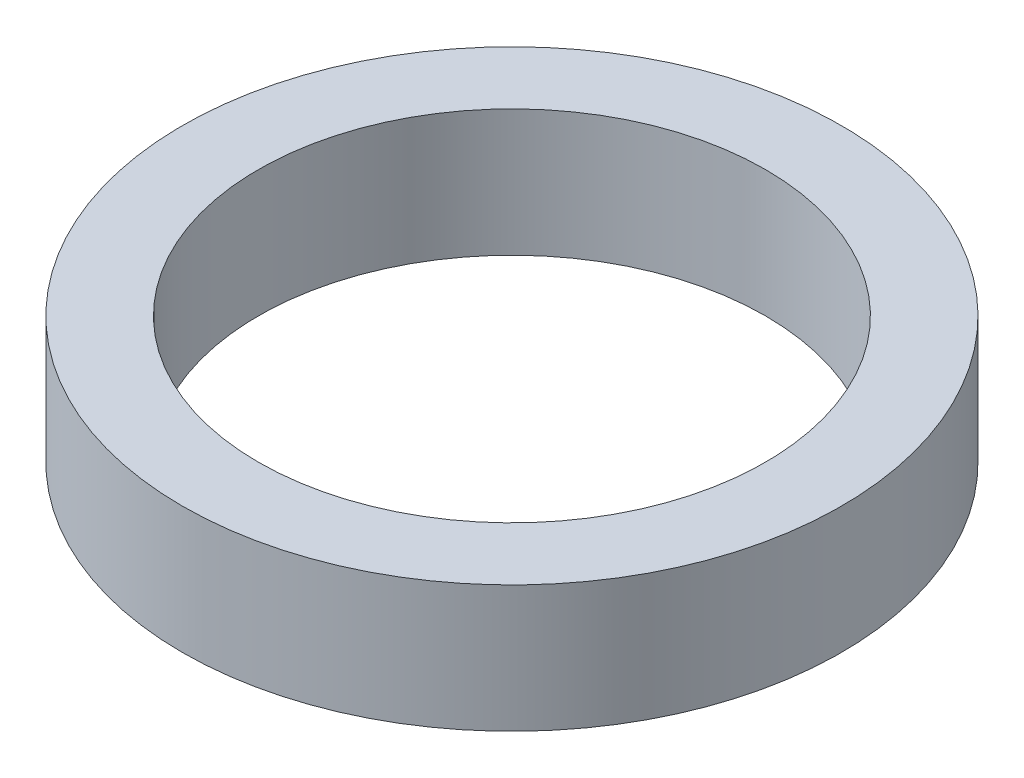
ISO-10303-21;
HEADER;
FILE_DESCRIPTION(('STEP AP214'),'2;1');
FILE_NAME('part.step','',(''),(''),'','','');
FILE_SCHEMA(('AUTOMOTIVE_DESIGN { 1 0 10303 214 1 1 1 1 }'));
ENDSEC;
DATA;
#1=APPLICATION_CONTEXT('core data for automotive mechanical design processes');
#2=APPLICATION_PROTOCOL_DEFINITION('international standard','automotive_design',2000,#1);
#3=PRODUCT_CONTEXT('',#1,'mechanical');
#4=PRODUCT('Part','Part','',(#3));
#5=PRODUCT_RELATED_PRODUCT_CATEGORY('part','',(#4));
#6=PRODUCT_DEFINITION_FORMATION('','',#4);
#7=PRODUCT_DEFINITION_CONTEXT('part definition',#1,'design');
#8=PRODUCT_DEFINITION('design','',#6,#7);
#9=PRODUCT_DEFINITION_SHAPE('','',#8);
#10=(LENGTH_UNIT() NAMED_UNIT(*) SI_UNIT(.MILLI.,.METRE.));
#11=(NAMED_UNIT(*) PLANE_ANGLE_UNIT() SI_UNIT($,.RADIAN.));
#12=(NAMED_UNIT(*) SI_UNIT($,.STERADIAN.) SOLID_ANGLE_UNIT());
#13=UNCERTAINTY_MEASURE_WITH_UNIT(LENGTH_MEASURE(1.E-05),#10,'distance_accuracy_value','');
#14=(GEOMETRIC_REPRESENTATION_CONTEXT(3) GLOBAL_UNCERTAINTY_ASSIGNED_CONTEXT((#13)) GLOBAL_UNIT_ASSIGNED_CONTEXT((#10,
#11,#12)) REPRESENTATION_CONTEXT('',''));
#15=CARTESIAN_POINT('',(0.,0.,0.));
#16=DIRECTION('',(0.,0.,1.));
#17=DIRECTION('',(1.,0.,0.));
#18=AXIS2_PLACEMENT_3D('',#15,#16,#17);
#19=CARTESIAN_POINT('',(0.,1.,0.));
#20=DIRECTION('',(0.,1.,0.));
#21=DIRECTION('',(0.,0.,1.));
#22=AXIS2_PLACEMENT_3D('',#19,#20,#21);
#23=PLANE('',#22);
#24=CARTESIAN_POINT('',(0.,1.,0.));
#25=DIRECTION('',(0.,1.,0.));
#26=DIRECTION('',(0.,0.,1.));
#27=AXIS2_PLACEMENT_3D('',#24,#25,#26);
#28=CIRCLE('',#27,2.6);
#29=CARTESIAN_POINT('',(0.,1.,2.6));
#30=VERTEX_POINT('',#29);
#31=EDGE_CURVE('E10',#30,#30,#28,.T.);
#32=ORIENTED_EDGE('',*,*,#31,.T.);
#33=EDGE_LOOP('',(#32));
#34=FACE_BOUND('',#33,.T.);
#35=CARTESIAN_POINT('',(0.,1.,0.));
#36=DIRECTION('',(0.,1.,0.));
#37=DIRECTION('',(0.,0.,1.));
#38=AXIS2_PLACEMENT_3D('',#35,#36,#37);
#39=CIRCLE('',#38,2.);
#40=CARTESIAN_POINT('',(0.,1.,2.));
#41=VERTEX_POINT('',#40);
#42=EDGE_CURVE('E50',#41,#41,#39,.T.);
#43=ORIENTED_EDGE('',*,*,#42,.F.);
#44=EDGE_LOOP('',(#43));
#45=FACE_BOUND('',#44,.T.);
#46=ADVANCED_FACE('F37',(#34,#45),#23,.T.);
#47=CARTESIAN_POINT('',(0.,0.,0.));
#48=DIRECTION('',(0.,1.,0.));
#49=DIRECTION('',(0.,0.,1.));
#50=AXIS2_PLACEMENT_3D('',#47,#48,#49);
#51=PLANE('',#50);
#52=CARTESIAN_POINT('',(0.,0.,0.));
#53=DIRECTION('',(0.,1.,0.));
#54=DIRECTION('',(0.,0.,1.));
#55=AXIS2_PLACEMENT_3D('',#52,#53,#54);
#56=CIRCLE('',#55,2.6);
#57=CARTESIAN_POINT('',(0.,0.,2.6));
#58=VERTEX_POINT('',#57);
#59=EDGE_CURVE('E41',#58,#58,#56,.T.);
#60=ORIENTED_EDGE('',*,*,#59,.F.);
#61=EDGE_LOOP('',(#60));
#62=FACE_BOUND('',#61,.T.);
#63=CARTESIAN_POINT('',(0.,0.,0.));
#64=DIRECTION('',(0.,1.,0.));
#65=DIRECTION('',(0.,0.,1.));
#66=AXIS2_PLACEMENT_3D('',#63,#64,#65);
#67=CIRCLE('',#66,2.);
#68=CARTESIAN_POINT('',(0.,0.,2.));
#69=VERTEX_POINT('',#68);
#70=EDGE_CURVE('E52',#69,#69,#67,.T.);
#71=ORIENTED_EDGE('',*,*,#70,.T.);
#72=EDGE_LOOP('',(#71));
#73=FACE_BOUND('',#72,.T.);
#74=ADVANCED_FACE('F64',(#62,#73),#51,.F.);
#75=CARTESIAN_POINT('',(0.,1.,0.));
#76=DIRECTION('',(0.,-1.,0.));
#77=DIRECTION('',(0.,0.,-1.));
#78=AXIS2_PLACEMENT_3D('',#75,#76,#77);
#79=CYLINDRICAL_SURFACE('',#78,2.6);
#80=ORIENTED_EDGE('',*,*,#31,.F.);
#81=EDGE_LOOP('',(#80));
#82=FACE_BOUND('',#81,.T.);
#83=ORIENTED_EDGE('',*,*,#59,.T.);
#84=EDGE_LOOP('',(#83));
#85=FACE_BOUND('',#84,.T.);
#86=ADVANCED_FACE('F39',(#82,#85),#79,.T.);
#87=CARTESIAN_POINT('',(0.,1.,0.));
#88=DIRECTION('',(0.,-1.,0.));
#89=DIRECTION('',(0.,0.,-1.));
#90=AXIS2_PLACEMENT_3D('',#87,#88,#89);
#91=CYLINDRICAL_SURFACE('',#90,2.);
#92=ORIENTED_EDGE('',*,*,#42,.T.);
#93=EDGE_LOOP('',(#92));
#94=FACE_BOUND('',#93,.T.);
#95=ORIENTED_EDGE('',*,*,#70,.F.);
#96=EDGE_LOOP('',(#95));
#97=FACE_BOUND('',#96,.T.);
#98=ADVANCED_FACE('F60',(#94,#97),#91,.F.);
#99=CLOSED_SHELL('',(#46,#74,#86,#98));
#100=MANIFOLD_SOLID_BREP('B2',#99);
#101=ADVANCED_BREP_SHAPE_REPRESENTATION('',(#18,#100),#14);
#102=SHAPE_DEFINITION_REPRESENTATION(#9,#101);
ENDSEC;
END-ISO-10303-21;
